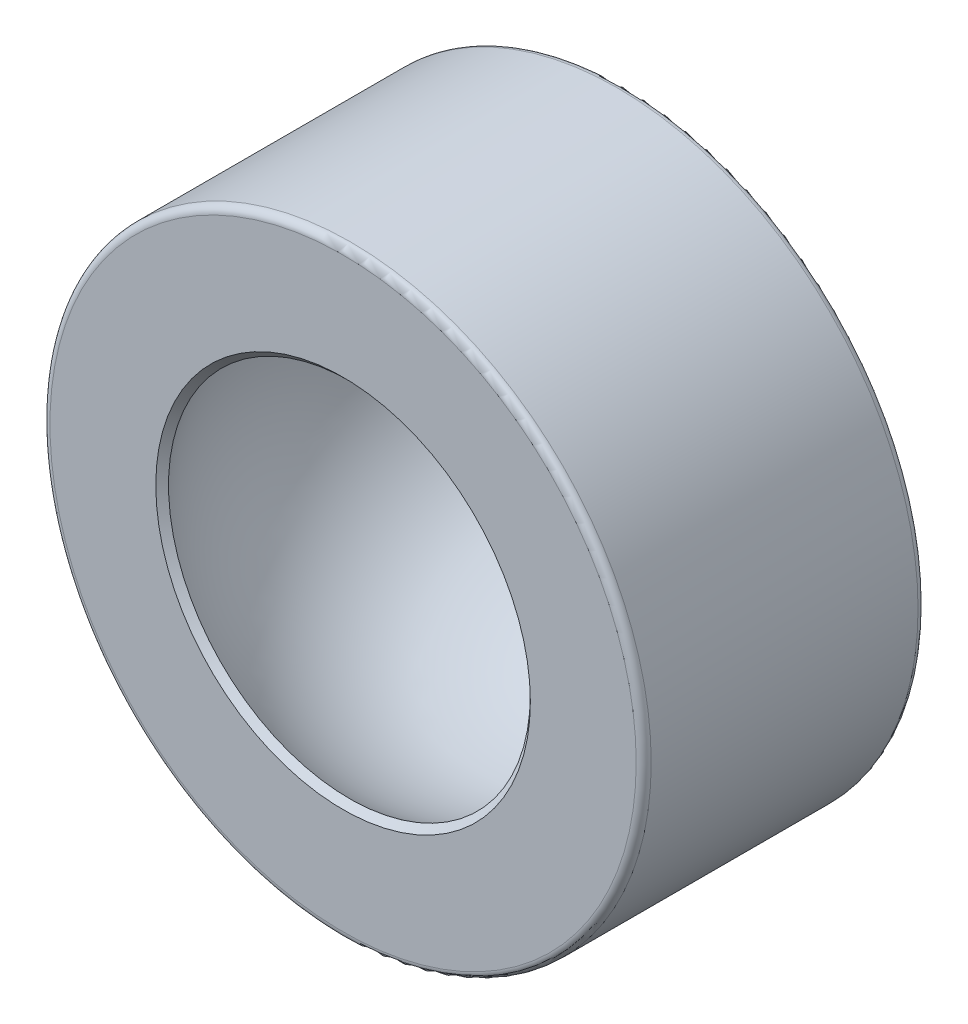
ISO-10303-21;
HEADER;
FILE_DESCRIPTION(('STEP AP214'),'2;1');
FILE_NAME('part.step','',(''),(''),'','','');
FILE_SCHEMA(('AUTOMOTIVE_DESIGN { 1 0 10303 214 1 1 1 1 }'));
ENDSEC;
DATA;
#1=APPLICATION_CONTEXT('core data for automotive mechanical design processes');
#2=APPLICATION_PROTOCOL_DEFINITION('international standard','automotive_design',2000,#1);
#3=PRODUCT_CONTEXT('',#1,'mechanical');
#4=PRODUCT('Part','Part','',(#3));
#5=PRODUCT_RELATED_PRODUCT_CATEGORY('part','',(#4));
#6=PRODUCT_DEFINITION_FORMATION('','',#4);
#7=PRODUCT_DEFINITION_CONTEXT('part definition',#1,'design');
#8=PRODUCT_DEFINITION('design','',#6,#7);
#9=PRODUCT_DEFINITION_SHAPE('','',#8);
#10=(LENGTH_UNIT() NAMED_UNIT(*) SI_UNIT(.MILLI.,.METRE.));
#11=(NAMED_UNIT(*) PLANE_ANGLE_UNIT() SI_UNIT($,.RADIAN.));
#12=(NAMED_UNIT(*) SI_UNIT($,.STERADIAN.) SOLID_ANGLE_UNIT());
#13=UNCERTAINTY_MEASURE_WITH_UNIT(LENGTH_MEASURE(1.E-05),#10,'distance_accuracy_value','');
#14=(GEOMETRIC_REPRESENTATION_CONTEXT(3) GLOBAL_UNCERTAINTY_ASSIGNED_CONTEXT((#13)) GLOBAL_UNIT_ASSIGNED_CONTEXT((#10,
#11,#12)) REPRESENTATION_CONTEXT('',''));
#15=CARTESIAN_POINT('',(0.,0.,0.));
#16=DIRECTION('',(0.,0.,1.));
#17=DIRECTION('',(1.,0.,0.));
#18=AXIS2_PLACEMENT_3D('',#15,#16,#17);
#19=CARTESIAN_POINT('',(0.,0.,-1.875));
#20=DIRECTION('',(0.,0.,1.));
#21=DIRECTION('',(1.,0.,0.));
#22=AXIS2_PLACEMENT_3D('',#19,#20,#21);
#23=CYLINDRICAL_SURFACE('',#22,4.);
#24=CARTESIAN_POINT('',(0.,0.,1.775));
#25=DIRECTION('',(0.,0.,1.));
#26=DIRECTION('',(1.,0.,0.));
#27=AXIS2_PLACEMENT_3D('',#24,#25,#26);
#28=CIRCLE('',#27,4.);
#29=CARTESIAN_POINT('',(4.,0.,1.775));
#30=VERTEX_POINT('',#29);
#31=EDGE_CURVE('E67',#30,#30,#28,.F.);
#32=ORIENTED_EDGE('',*,*,#31,.T.);
#33=EDGE_LOOP('',(#32));
#34=FACE_BOUND('',#33,.T.);
#35=CARTESIAN_POINT('',(0.,0.,-1.775));
#36=DIRECTION('',(0.,0.,1.));
#37=DIRECTION('',(1.,0.,0.));
#38=AXIS2_PLACEMENT_3D('',#35,#36,#37);
#39=CIRCLE('',#38,4.);
#40=CARTESIAN_POINT('',(4.,0.,-1.775));
#41=VERTEX_POINT('',#40);
#42=EDGE_CURVE('E71',#41,#41,#39,.T.);
#43=ORIENTED_EDGE('',*,*,#42,.T.);
#44=EDGE_LOOP('',(#43));
#45=FACE_BOUND('',#44,.T.);
#46=ADVANCED_FACE('F39',(#34,#45),#23,.T.);
#47=CARTESIAN_POINT('',(0.,0.,-1.875));
#48=DIRECTION('',(0.,0.,1.));
#49=DIRECTION('',(1.,0.,0.));
#50=AXIS2_PLACEMENT_3D('',#47,#48,#49);
#51=PLANE('',#50);
#52=CARTESIAN_POINT('',(0.,0.,-1.875));
#53=DIRECTION('',(0.,0.,1.));
#54=DIRECTION('',(1.,0.,0.));
#55=AXIS2_PLACEMENT_3D('',#52,#53,#54);
#56=CIRCLE('',#55,2.44858836354783);
#57=CARTESIAN_POINT('',(2.44858836354783,0.,-1.875));
#58=VERTEX_POINT('',#57);
#59=EDGE_CURVE('E57',#58,#58,#56,.T.);
#60=ORIENTED_EDGE('',*,*,#59,.T.);
#61=EDGE_LOOP('',(#60));
#62=FACE_BOUND('',#61,.T.);
#63=CARTESIAN_POINT('',(0.,0.,-1.875));
#64=DIRECTION('',(0.,0.,1.));
#65=DIRECTION('',(1.,0.,0.));
#66=AXIS2_PLACEMENT_3D('',#63,#64,#65);
#67=CIRCLE('',#66,3.9);
#68=CARTESIAN_POINT('',(3.9,0.,-1.875));
#69=VERTEX_POINT('',#68);
#70=EDGE_CURVE('E63',#69,#69,#67,.F.);
#71=ORIENTED_EDGE('',*,*,#70,.T.);
#72=EDGE_LOOP('',(#71));
#73=FACE_BOUND('',#72,.T.);
#74=ADVANCED_FACE('F99',(#62,#73),#51,.F.);
#75=CARTESIAN_POINT('',(0.,0.,1.875));
#76=DIRECTION('',(0.,0.,1.));
#77=DIRECTION('',(1.,0.,0.));
#78=AXIS2_PLACEMENT_3D('',#75,#76,#77);
#79=PLANE('',#78);
#80=CARTESIAN_POINT('',(0.,0.,1.875));
#81=DIRECTION('',(0.,0.,1.));
#82=DIRECTION('',(1.,0.,0.));
#83=AXIS2_PLACEMENT_3D('',#80,#81,#82);
#84=CIRCLE('',#83,2.4918742493994);
#85=CARTESIAN_POINT('',(2.4918742493994,0.,1.875));
#86=VERTEX_POINT('',#85);
#87=EDGE_CURVE('E10',#86,#86,#84,.F.);
#88=ORIENTED_EDGE('',*,*,#87,.T.);
#89=EDGE_LOOP('',(#88));
#90=FACE_BOUND('',#89,.T.);
#91=CARTESIAN_POINT('',(0.,0.,1.875));
#92=DIRECTION('',(0.,0.,1.));
#93=DIRECTION('',(1.,0.,0.));
#94=AXIS2_PLACEMENT_3D('',#91,#92,#93);
#95=CIRCLE('',#94,3.9);
#96=CARTESIAN_POINT('',(3.9,0.,1.875));
#97=VERTEX_POINT('',#96);
#98=EDGE_CURVE('E75',#97,#97,#95,.T.);
#99=ORIENTED_EDGE('',*,*,#98,.T.);
#100=EDGE_LOOP('',(#99));
#101=FACE_BOUND('',#100,.T.);
#102=ADVANCED_FACE('F80',(#90,#101),#79,.T.);
#103=CARTESIAN_POINT('',(0.,0.,0.));
#104=DIRECTION('',(0.,1.,0.));
#105=DIRECTION('',(1.,0.,0.));
#106=AXIS2_PLACEMENT_3D('',#103,#104,#105);
#107=SPHERICAL_SURFACE('',#106,3.);
#108=CARTESIAN_POINT('',(0.,0.,0.));
#109=DIRECTION('',(0.,0.,1.));
#110=DIRECTION('',(1.,0.,0.));
#111=AXIS2_PLACEMENT_3D('',#108,#109,#110);
#112=SPHERICAL_SURFACE('',#111,3.);
#113=CARTESIAN_POINT('',(0.,0.,-1.75235006248991));
#114=DIRECTION('',(0.,0.,1.));
#115=DIRECTION('',(1.,0.,0.));
#116=AXIS2_PLACEMENT_3D('',#113,#114,#115);
#117=CIRCLE('',#116,2.435009087969);
#118=CARTESIAN_POINT('',(2.43500908796899,0.,-1.75235006248991));
#119=VERTEX_POINT('',#118);
#120=EDGE_CURVE('E47',#119,#119,#117,.F.);
#121=ORIENTED_EDGE('',*,*,#120,.T.);
#122=EDGE_LOOP('',(#121));
#123=FACE_BOUND('',#122,.T.);
#124=CARTESIAN_POINT('',(0.,0.,1.79034026704698));
#125=DIRECTION('',(0.,0.,-1.));
#126=DIRECTION('',(-1.,0.,0.));
#127=AXIS2_PLACEMENT_3D('',#124,#125,#126);
#128=CIRCLE('',#127,2.40721451644638);
#129=CARTESIAN_POINT('',(2.40721451644638,0.,1.79034026704698));
#130=VERTEX_POINT('',#129);
#131=EDGE_CURVE('E52',#130,#130,#128,.F.);
#132=ORIENTED_EDGE('',*,*,#131,.T.);
#133=EDGE_LOOP('',(#132));
#134=FACE_BOUND('',#133,.T.);
#135=ADVANCED_FACE('F85',(#123,#134),#112,.F.);
#136=CARTESIAN_POINT('',(0.,0.,1.775));
#137=DIRECTION('',(0.,0.,1.));
#138=DIRECTION('',(1.,0.,0.));
#139=AXIS2_PLACEMENT_3D('',#136,#137,#138);
#140=TOROIDAL_SURFACE('',#139,3.9,0.1);
#141=ORIENTED_EDGE('',*,*,#31,.F.);
#142=EDGE_LOOP('',(#141));
#143=FACE_BOUND('',#142,.T.);
#144=ORIENTED_EDGE('',*,*,#98,.F.);
#145=EDGE_LOOP('',(#144));
#146=FACE_BOUND('',#145,.T.);
#147=ADVANCED_FACE('F82',(#143,#146),#140,.T.);
#148=CARTESIAN_POINT('',(0.,0.,-1.775));
#149=DIRECTION('',(0.,0.,1.));
#150=DIRECTION('',(1.,0.,0.));
#151=AXIS2_PLACEMENT_3D('',#148,#149,#150);
#152=TOROIDAL_SURFACE('',#151,3.9,0.1);
#153=ORIENTED_EDGE('',*,*,#70,.F.);
#154=EDGE_LOOP('',(#153));
#155=FACE_BOUND('',#154,.T.);
#156=ORIENTED_EDGE('',*,*,#42,.F.);
#157=EDGE_LOOP('',(#156));
#158=FACE_BOUND('',#157,.T.);
#159=ADVANCED_FACE('F84',(#155,#158),#152,.T.);
#160=CARTESIAN_POINT('',(0.,0.,-1.875));
#161=DIRECTION('',(0.,0.,-1.));
#162=DIRECTION('',(-1.,0.,0.));
#163=AXIS2_PLACEMENT_3D('',#160,#161,#162);
#164=CONICAL_SURFACE('',#163,2.44858836354783,0.110266630460412);
#165=ORIENTED_EDGE('',*,*,#120,.F.);
#166=EDGE_LOOP('',(#165));
#167=FACE_BOUND('',#166,.T.);
#168=ORIENTED_EDGE('',*,*,#59,.F.);
#169=EDGE_LOOP('',(#168));
#170=FACE_BOUND('',#169,.T.);
#171=ADVANCED_FACE('F92',(#167,#170),#164,.F.);
#172=CARTESIAN_POINT('',(0.,0.,1.79034026704698));
#173=DIRECTION('',(0.,0.,1.));
#174=DIRECTION('',(1.,0.,0.));
#175=AXIS2_PLACEMENT_3D('',#172,#173,#174);
#176=CONICAL_SURFACE('',#175,2.40721451644638,0.785398163397448);
#177=CARTESIAN_POINT('',(2.4918742493994,0.,1.875));
#178=CARTESIAN_POINT('',(2.49099237718114,0.,1.87411812778174));
#179=CARTESIAN_POINT('',(2.49011050496288,0.,1.87323625556348));
#180=CARTESIAN_POINT('',(2.48834676052636,0.,1.87147251112696));
#181=CARTESIAN_POINT('',(2.4874648883081,0.,1.8705906389087));
#182=CARTESIAN_POINT('',(2.48570114387158,0.,1.86882689447218));
#183=CARTESIAN_POINT('',(2.48481927165331,0.,1.86794502225391));
#184=CARTESIAN_POINT('',(2.48305552721679,0.,1.86618127781739));
#185=CARTESIAN_POINT('',(2.48217365499853,0.,1.86529940559913));
#186=CARTESIAN_POINT('',(2.48040991056201,0.,1.86353566116261));
#187=CARTESIAN_POINT('',(2.47952803834375,0.,1.86265378894435));
#188=CARTESIAN_POINT('',(2.47776429390723,0.,1.86089004450783));
#189=CARTESIAN_POINT('',(2.47688242168897,0.,1.86000817228957));
#190=CARTESIAN_POINT('',(2.47511867725245,0.,1.85824442785305));
#191=CARTESIAN_POINT('',(2.47423680503419,0.,1.85736255563479));
#192=CARTESIAN_POINT('',(2.47247306059767,0.,1.85559881119827));
#193=CARTESIAN_POINT('',(2.4715911883794,0.,1.85471693898));
#194=CARTESIAN_POINT('',(2.46982744394288,0.,1.85295319454348));
#195=CARTESIAN_POINT('',(2.46894557172462,0.,1.85207132232522));
#196=CARTESIAN_POINT('',(2.4671818272881,0.,1.8503075778887));
#197=CARTESIAN_POINT('',(2.46629995506984,0.,1.84942570567044));
#198=CARTESIAN_POINT('',(2.46453621063332,0.,1.84766196123392));
#199=CARTESIAN_POINT('',(2.46365433841506,0.,1.84678008901566));
#200=CARTESIAN_POINT('',(2.46189059397854,0.,1.84501634457914));
#201=CARTESIAN_POINT('',(2.46100872176028,0.,1.84413447236088));
#202=CARTESIAN_POINT('',(2.45924497732376,0.,1.84237072792436));
#203=CARTESIAN_POINT('',(2.45836310510549,0.,1.84148885570609));
#204=CARTESIAN_POINT('',(2.45659936066897,0.,1.83972511126957));
#205=CARTESIAN_POINT('',(2.45571748845071,0.,1.83884323905131));
#206=CARTESIAN_POINT('',(2.45395374401419,0.,1.83707949461479));
#207=CARTESIAN_POINT('',(2.45307187179593,0.,1.83619762239653));
#208=CARTESIAN_POINT('',(2.45130812735941,0.,1.83443387796001));
#209=CARTESIAN_POINT('',(2.45042625514115,0.,1.83355200574175));
#210=CARTESIAN_POINT('',(2.44866251070463,0.,1.83178826130523));
#211=CARTESIAN_POINT('',(2.44778063848637,0.,1.83090638908697));
#212=CARTESIAN_POINT('',(2.44601689404985,0.,1.82914264465045));
#213=CARTESIAN_POINT('',(2.44513502183158,0.,1.82826077243218));
#214=CARTESIAN_POINT('',(2.44337127739506,0.,1.82649702799566));
#215=CARTESIAN_POINT('',(2.4424894051768,0.,1.8256151557774));
#216=CARTESIAN_POINT('',(2.44072566074028,0.,1.82385141134088));
#217=CARTESIAN_POINT('',(2.43984378852202,0.,1.82296953912262));
#218=CARTESIAN_POINT('',(2.4380800440855,0.,1.8212057946861));
#219=CARTESIAN_POINT('',(2.43719817186724,0.,1.82032392246784));
#220=CARTESIAN_POINT('',(2.43543442743072,0.,1.81856017803132));
#221=CARTESIAN_POINT('',(2.43455255521246,0.,1.81767830581306));
#222=CARTESIAN_POINT('',(2.43278881077594,0.,1.81591456137654));
#223=CARTESIAN_POINT('',(2.43190693855767,0.,1.81503268915827));
#224=CARTESIAN_POINT('',(2.43014319412115,0.,1.81326894472175));
#225=CARTESIAN_POINT('',(2.42926132190289,0.,1.81238707250349));
#226=CARTESIAN_POINT('',(2.42749757746637,0.,1.81062332806697));
#227=CARTESIAN_POINT('',(2.42661570524811,0.,1.80974145584871));
#228=CARTESIAN_POINT('',(2.42485196081159,0.,1.80797771141219));
#229=CARTESIAN_POINT('',(2.42397008859333,0.,1.80709583919393));
#230=CARTESIAN_POINT('',(2.42220634415681,0.,1.80533209475741));
#231=CARTESIAN_POINT('',(2.42132447193855,0.,1.80445022253915));
#232=CARTESIAN_POINT('',(2.41956072750203,0.,1.80268647810263));
#233=CARTESIAN_POINT('',(2.41867885528376,0.,1.80180460588436));
#234=CARTESIAN_POINT('',(2.41691511084724,0.,1.80004086144784));
#235=CARTESIAN_POINT('',(2.41603323862898,0.,1.79915898922958));
#236=CARTESIAN_POINT('',(2.41426949419246,0.,1.79739524479306));
#237=CARTESIAN_POINT('',(2.4133876219742,0.,1.7965133725748));
#238=CARTESIAN_POINT('',(2.41162387753768,0.,1.79474962813828));
#239=CARTESIAN_POINT('',(2.41074200531942,0.,1.79386775592002));
#240=CARTESIAN_POINT('',(2.4089782608829,0.,1.7921040114835));
#241=CARTESIAN_POINT('',(2.40809638866464,0.,1.79122213926524));
#242=CARTESIAN_POINT('',(2.40721451644638,0.,1.79034026704698));
#243=B_SPLINE_CURVE_WITH_KNOTS('',3,(#177,#178,#179,#180,#181,#182,#183,#184,#185,#186,#187,
#188,#189,#190,#191,#192,#193,#194,#195,#196,#197,#198,#199,#200,#201,#202,#203,#204,#205,#206,
#207,#208,#209,#210,#211,#212,#213,#214,#215,#216,#217,#218,#219,#220,#221,#222,#223,#224,#225,
#226,#227,#228,#229,#230,#231,#232,#233,#234,#235,#236,#237,#238,#239,#240,#241,#242),
.UNSPECIFIED.,.F.,.F.,(4,2,2,2,2,2,2,2,2,2,2,2,2,2,2,2,2,2,2,2,2,2,2,2,2,2,2,2,2,2,2,2,4),(0.,
0.00374146695403291,0.00748293390806566,0.0112244008620984,0.0149658678161315,
0.0187073347701641,0.0224488017241968,0.0261902686782299,0.0299317356322627,0.0336732025862956,
0.0374146695403283,0.0411561364943611,0.0448976034483941,0.0486390704024267,0.0523805373564598,
0.0561220043104926,0.0598634712645253,0.0636049382185582,0.067346405172591,0.0710878721266237,
0.0748293390806568,0.0785708060346894,0.0823122729887221,0.0860537399427552,0.0897952068967879,
0.0935366738508209,0.0972781408048536,0.101019607758886,0.104761074712919,0.108502541666952,
0.112244008620985,0.115985475575018,0.11972694252905),.UNSPECIFIED.);
#244=EDGE_CURVE('BSEAM41',#86,#130,#243,.T.);
#245=ORIENTED_EDGE('',*,*,#87,.F.);
#246=ORIENTED_EDGE('',*,*,#131,.F.);
#247=ORIENTED_EDGE('',*,*,#244,.T.);
#248=ORIENTED_EDGE('',*,*,#244,.F.);
#249=EDGE_LOOP('',(#245,#247,#246,#248));
#250=FACE_BOUND('',#249,.T.);
#251=ADVANCED_FACE('F41',(#250),#176,.F.);
#252=CLOSED_SHELL('',(#46,#74,#102,#135,#147,#159,#171,#251));
#253=MANIFOLD_SOLID_BREP('B2',#252);
#254=ADVANCED_BREP_SHAPE_REPRESENTATION('',(#18,#253),#14);
#255=SHAPE_DEFINITION_REPRESENTATION(#9,#254);
ENDSEC;
END-ISO-10303-21;
